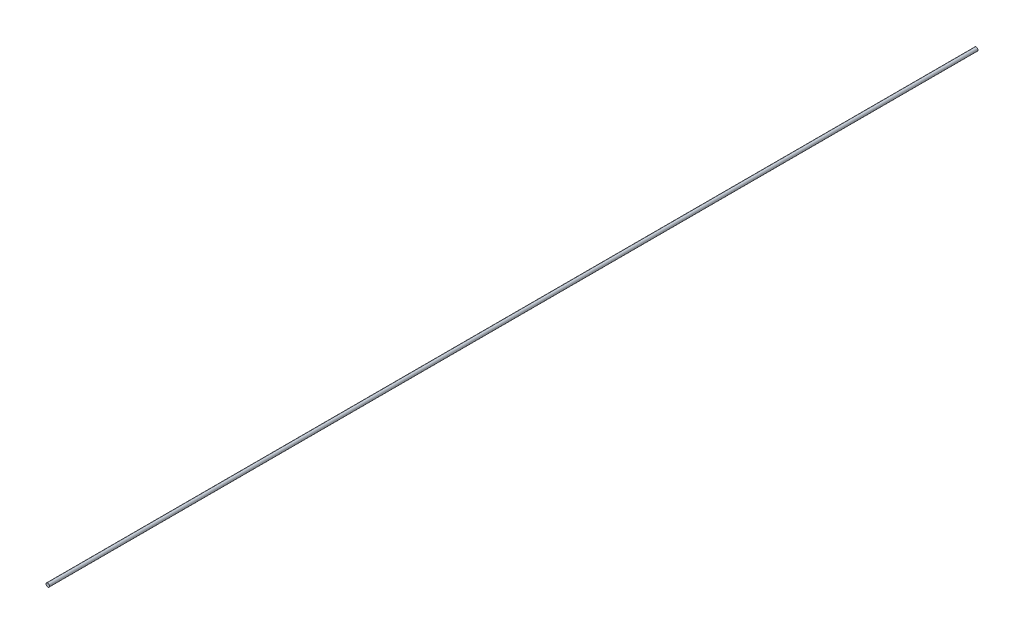
ISO-10303-21;
HEADER;
FILE_DESCRIPTION(('STEP AP214'),'2;1');
FILE_NAME('part.step','',(''),(''),'','','');
FILE_SCHEMA(('AUTOMOTIVE_DESIGN { 1 0 10303 214 1 1 1 1 }'));
ENDSEC;
DATA;
#1=APPLICATION_CONTEXT('core data for automotive mechanical design processes');
#2=APPLICATION_PROTOCOL_DEFINITION('international standard','automotive_design',2000,#1);
#3=PRODUCT_CONTEXT('',#1,'mechanical');
#4=PRODUCT('Part','Part','',(#3));
#5=PRODUCT_RELATED_PRODUCT_CATEGORY('part','',(#4));
#6=PRODUCT_DEFINITION_FORMATION('','',#4);
#7=PRODUCT_DEFINITION_CONTEXT('part definition',#1,'design');
#8=PRODUCT_DEFINITION('design','',#6,#7);
#9=PRODUCT_DEFINITION_SHAPE('','',#8);
#10=(LENGTH_UNIT() NAMED_UNIT(*) SI_UNIT(.MILLI.,.METRE.));
#11=(NAMED_UNIT(*) PLANE_ANGLE_UNIT() SI_UNIT($,.RADIAN.));
#12=(NAMED_UNIT(*) SI_UNIT($,.STERADIAN.) SOLID_ANGLE_UNIT());
#13=UNCERTAINTY_MEASURE_WITH_UNIT(LENGTH_MEASURE(1.E-05),#10,'distance_accuracy_value','');
#14=(GEOMETRIC_REPRESENTATION_CONTEXT(3) GLOBAL_UNCERTAINTY_ASSIGNED_CONTEXT((#13)) GLOBAL_UNIT_ASSIGNED_CONTEXT((#10,
#11,#12)) REPRESENTATION_CONTEXT('',''));
#15=CARTESIAN_POINT('',(0.,0.,0.));
#16=DIRECTION('',(0.,0.,1.));
#17=DIRECTION('',(1.,0.,0.));
#18=AXIS2_PLACEMENT_3D('',#15,#16,#17);
#19=CARTESIAN_POINT('',(0.,0.,2000.));
#20=DIRECTION('',(0.,0.,-1.));
#21=DIRECTION('',(-1.,0.,0.));
#22=AXIS2_PLACEMENT_3D('',#19,#20,#21);
#23=CYLINDRICAL_SURFACE('',#22,3.8);
#24=CARTESIAN_POINT('',(0.,0.,2000.));
#25=DIRECTION('',(0.,0.,1.));
#26=DIRECTION('',(1.,0.,0.));
#27=AXIS2_PLACEMENT_3D('',#24,#25,#26);
#28=CIRCLE('',#27,3.8);
#29=CARTESIAN_POINT('',(3.8,0.,2000.));
#30=VERTEX_POINT('',#29);
#31=EDGE_CURVE('E10',#30,#30,#28,.T.);
#32=ORIENTED_EDGE('',*,*,#31,.F.);
#33=EDGE_LOOP('',(#32));
#34=FACE_BOUND('',#33,.T.);
#35=CARTESIAN_POINT('',(0.,0.,0.));
#36=DIRECTION('',(0.,0.,1.));
#37=DIRECTION('',(1.,0.,0.));
#38=AXIS2_PLACEMENT_3D('',#35,#36,#37);
#39=CIRCLE('',#38,3.8);
#40=CARTESIAN_POINT('',(3.8,0.,0.));
#41=VERTEX_POINT('',#40);
#42=EDGE_CURVE('E40',#41,#41,#39,.T.);
#43=ORIENTED_EDGE('',*,*,#42,.T.);
#44=EDGE_LOOP('',(#43));
#45=FACE_BOUND('',#44,.T.);
#46=ADVANCED_FACE('F37',(#34,#45),#23,.T.);
#47=CARTESIAN_POINT('',(0.,0.,2000.));
#48=DIRECTION('',(0.,0.,1.));
#49=DIRECTION('',(1.,0.,0.));
#50=AXIS2_PLACEMENT_3D('',#47,#48,#49);
#51=PLANE('',#50);
#52=ORIENTED_EDGE('',*,*,#31,.T.);
#53=EDGE_LOOP('',(#52));
#54=FACE_BOUND('',#53,.T.);
#55=ADVANCED_FACE('F54',(#54),#51,.T.);
#56=CARTESIAN_POINT('',(0.,0.,0.));
#57=DIRECTION('',(0.,0.,1.));
#58=DIRECTION('',(1.,0.,0.));
#59=AXIS2_PLACEMENT_3D('',#56,#57,#58);
#60=PLANE('',#59);
#61=ORIENTED_EDGE('',*,*,#42,.F.);
#62=EDGE_LOOP('',(#61));
#63=FACE_BOUND('',#62,.T.);
#64=ADVANCED_FACE('F52',(#63),#60,.F.);
#65=CLOSED_SHELL('',(#46,#55,#64));
#66=MANIFOLD_SOLID_BREP('B2',#65);
#67=ADVANCED_BREP_SHAPE_REPRESENTATION('',(#18,#66),#14);
#68=SHAPE_DEFINITION_REPRESENTATION(#9,#67);
ENDSEC;
END-ISO-10303-21;
